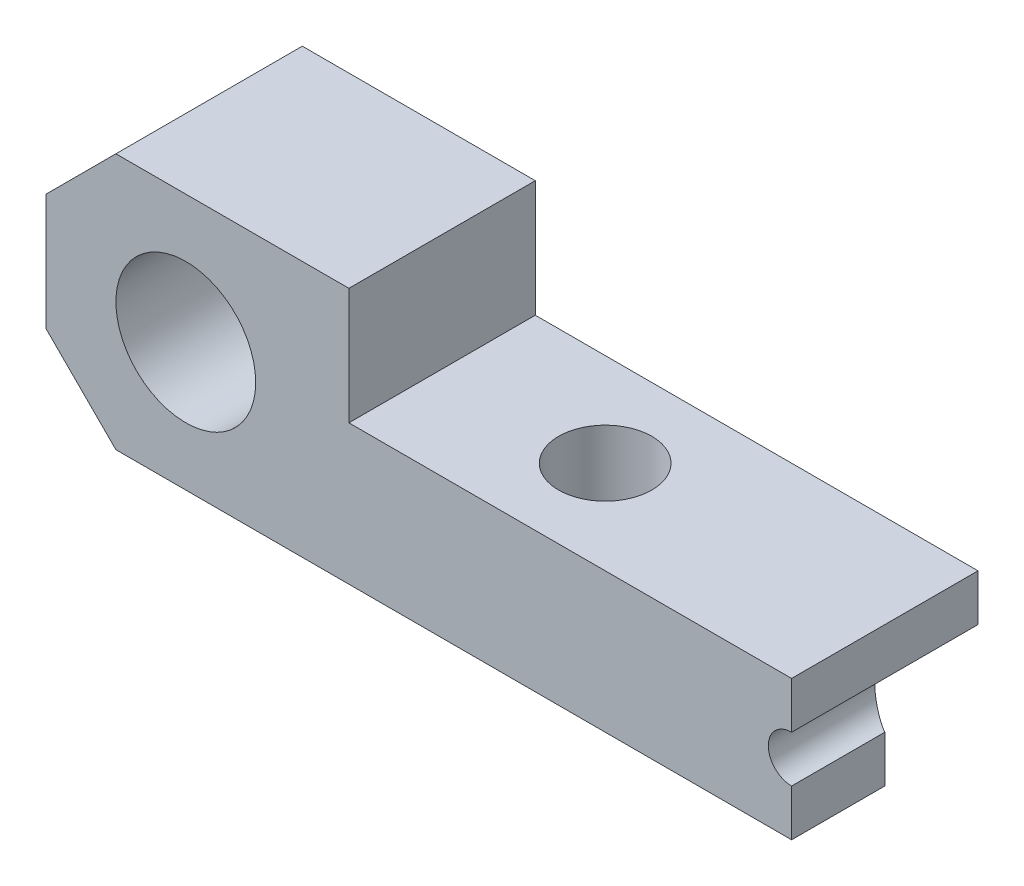
ISO-10303-21;
HEADER;
FILE_DESCRIPTION(('STEP AP214'),'2;1');
FILE_NAME('part.step','',(''),(''),'','','');
FILE_SCHEMA(('AUTOMOTIVE_DESIGN { 1 0 10303 214 1 1 1 1 }'));
ENDSEC;
DATA;
#1=APPLICATION_CONTEXT('core data for automotive mechanical design processes');
#2=APPLICATION_PROTOCOL_DEFINITION('international standard','automotive_design',2000,#1);
#3=PRODUCT_CONTEXT('',#1,'mechanical');
#4=PRODUCT('Part','Part','',(#3));
#5=PRODUCT_RELATED_PRODUCT_CATEGORY('part','',(#4));
#6=PRODUCT_DEFINITION_FORMATION('','',#4);
#7=PRODUCT_DEFINITION_CONTEXT('part definition',#1,'design');
#8=PRODUCT_DEFINITION('design','',#6,#7);
#9=PRODUCT_DEFINITION_SHAPE('','',#8);
#10=(LENGTH_UNIT() NAMED_UNIT(*) SI_UNIT(.MILLI.,.METRE.));
#11=(NAMED_UNIT(*) PLANE_ANGLE_UNIT() SI_UNIT($,.RADIAN.));
#12=(NAMED_UNIT(*) SI_UNIT($,.STERADIAN.) SOLID_ANGLE_UNIT());
#13=UNCERTAINTY_MEASURE_WITH_UNIT(LENGTH_MEASURE(1.E-05),#10,'distance_accuracy_value','');
#14=(GEOMETRIC_REPRESENTATION_CONTEXT(3) GLOBAL_UNCERTAINTY_ASSIGNED_CONTEXT((#13)) GLOBAL_UNIT_ASSIGNED_CONTEXT((#10,
#11,#12)) REPRESENTATION_CONTEXT('',''));
#15=CARTESIAN_POINT('',(0.,0.,0.));
#16=DIRECTION('',(0.,0.,1.));
#17=DIRECTION('',(1.,0.,0.));
#18=AXIS2_PLACEMENT_3D('',#15,#16,#17);
#19=CARTESIAN_POINT('',(32.,0.,8.));
#20=DIRECTION('',(-1.,0.,0.));
#21=DIRECTION('',(0.,0.,1.));
#22=AXIS2_PLACEMENT_3D('',#19,#20,#21);
#23=PLANE('',#22);
#24=DIRECTION('',(0.,0.,-1.));
#25=VECTOR('',#24,1.);
#26=CARTESIAN_POINT('',(32.,0.,8.));
#27=LINE('',#26,#25);
#28=CARTESIAN_POINT('',(32.,0.,8.));
#29=VERTEX_POINT('',#28);
#30=CARTESIAN_POINT('',(32.,0.,4.));
#31=VERTEX_POINT('',#30);
#32=EDGE_CURVE('E156',#29,#31,#27,.T.);
#33=ORIENTED_EDGE('',*,*,#32,.T.);
#34=DIRECTION('',(0.,-1.,0.));
#35=VECTOR('',#34,1.);
#36=CARTESIAN_POINT('',(32.,4.,4.));
#37=LINE('',#36,#35);
#38=CARTESIAN_POINT('',(32.,2.,4.));
#39=VERTEX_POINT('',#38);
#40=EDGE_CURVE('E141',#39,#31,#37,.T.);
#41=ORIENTED_EDGE('',*,*,#40,.F.);
#42=DIRECTION('',(0.,0.,1.));
#43=VECTOR('',#42,1.);
#44=CARTESIAN_POINT('',(32.,2.,0.));
#45=LINE('',#44,#43);
#46=CARTESIAN_POINT('',(32.,2.,8.));
#47=VERTEX_POINT('',#46);
#48=EDGE_CURVE('E149',#39,#47,#45,.T.);
#49=ORIENTED_EDGE('',*,*,#48,.T.);
#50=DIRECTION('',(0.,1.,0.));
#51=VECTOR('',#50,1.);
#52=CARTESIAN_POINT('',(32.,0.,8.));
#53=LINE('',#52,#51);
#54=EDGE_CURVE('E245',#29,#47,#53,.T.);
#55=ORIENTED_EDGE('',*,*,#54,.F.);
#56=EDGE_LOOP('',(#33,#41,#49,#55));
#57=FACE_BOUND('',#56,.T.);
#58=ADVANCED_FACE('F35',(#57),#23,.F.);
#59=CARTESIAN_POINT('',(0.,6.,8.));
#60=DIRECTION('',(0.,0.,1.));
#61=DIRECTION('',(1.,0.,0.));
#62=AXIS2_PLACEMENT_3D('',#59,#60,#61);
#63=PLANE('',#62);
#64=DIRECTION('',(0.,-1.,0.));
#65=VECTOR('',#64,1.);
#66=CARTESIAN_POINT('',(0.,0.,8.));
#67=LINE('',#66,#65);
#68=CARTESIAN_POINT('',(0.,8.00000000000001,8.));
#69=VERTEX_POINT('',#68);
#70=CARTESIAN_POINT('',(0.,3.00000000000001,8.));
#71=VERTEX_POINT('',#70);
#72=EDGE_CURVE('E188',#69,#71,#67,.T.);
#73=ORIENTED_EDGE('',*,*,#72,.T.);
#74=DIRECTION('',(-0.707106781186547,0.707106781186548,0.));
#75=VECTOR('',#74,1.);
#76=CARTESIAN_POINT('',(-1.5,4.50000000000001,8.));
#77=LINE('',#76,#75);
#78=CARTESIAN_POINT('',(3.,0.,8.));
#79=VERTEX_POINT('',#78);
#80=EDGE_CURVE('E43',#71,#79,#77,.F.);
#81=ORIENTED_EDGE('',*,*,#80,.T.);
#82=DIRECTION('',(1.,0.,0.));
#83=VECTOR('',#82,1.);
#84=CARTESIAN_POINT('',(0.,0.,8.));
#85=LINE('',#84,#83);
#86=EDGE_CURVE('E186',#79,#29,#85,.T.);
#87=ORIENTED_EDGE('',*,*,#86,.T.);
#88=ORIENTED_EDGE('',*,*,#54,.T.);
#89=CARTESIAN_POINT('',(32.,3.,8.));
#90=DIRECTION('',(0.,0.,1.));
#91=DIRECTION('',(1.,0.,0.));
#92=AXIS2_PLACEMENT_3D('',#89,#90,#91);
#93=CIRCLE('',#92,0.999999999999998);
#94=CARTESIAN_POINT('',(32.,4.,8.));
#95=VERTEX_POINT('',#94);
#96=EDGE_CURVE('E251',#95,#47,#93,.T.);
#97=ORIENTED_EDGE('',*,*,#96,.F.);
#98=CARTESIAN_POINT('',(32.,6.,8.));
#99=VERTEX_POINT('',#98);
#100=EDGE_CURVE('E155',#95,#99,#53,.T.);
#101=ORIENTED_EDGE('',*,*,#100,.T.);
#102=DIRECTION('',(-1.,0.,0.));
#103=VECTOR('',#102,1.);
#104=CARTESIAN_POINT('',(32.,6.,8.));
#105=LINE('',#104,#103);
#106=CARTESIAN_POINT('',(13.,6.,8.));
#107=VERTEX_POINT('',#106);
#108=EDGE_CURVE('E235',#99,#107,#105,.T.);
#109=ORIENTED_EDGE('',*,*,#108,.T.);
#110=DIRECTION('',(0.,1.,0.));
#111=VECTOR('',#110,1.);
#112=CARTESIAN_POINT('',(13.,11.,8.));
#113=LINE('',#112,#111);
#114=CARTESIAN_POINT('',(13.,11.,8.));
#115=VERTEX_POINT('',#114);
#116=EDGE_CURVE('E244',#107,#115,#113,.T.);
#117=ORIENTED_EDGE('',*,*,#116,.T.);
#118=DIRECTION('',(-1.,0.,0.));
#119=VECTOR('',#118,1.);
#120=CARTESIAN_POINT('',(0.,11.,8.));
#121=LINE('',#120,#119);
#122=CARTESIAN_POINT('',(3.,11.,8.));
#123=VERTEX_POINT('',#122);
#124=EDGE_CURVE('E214',#115,#123,#121,.T.);
#125=ORIENTED_EDGE('',*,*,#124,.T.);
#126=DIRECTION('',(0.707106781186549,0.707106781186546,0.));
#127=VECTOR('',#126,1.);
#128=CARTESIAN_POINT('',(-1.00000000000001,7.,8.));
#129=LINE('',#128,#127);
#130=EDGE_CURVE('E179',#123,#69,#129,.F.);
#131=ORIENTED_EDGE('',*,*,#130,.T.);
#132=EDGE_LOOP('',(#73,#81,#87,#88,#97,#101,#109,#117,#125,#131));
#133=FACE_BOUND('',#132,.T.);
#134=CARTESIAN_POINT('',(6.,5.5,8.));
#135=DIRECTION('',(0.,0.,1.));
#136=DIRECTION('',(1.,0.,0.));
#137=AXIS2_PLACEMENT_3D('',#134,#135,#136);
#138=CIRCLE('',#137,3.);
#139=CARTESIAN_POINT('',(9.,5.5,8.));
#140=VERTEX_POINT('',#139);
#141=EDGE_CURVE('E206',#140,#140,#138,.T.);
#142=ORIENTED_EDGE('',*,*,#141,.F.);
#143=EDGE_LOOP('',(#142));
#144=FACE_BOUND('',#143,.T.);
#145=ADVANCED_FACE('F183',(#133,#144),#63,.T.);
#146=CARTESIAN_POINT('',(0.,6.,0.));
#147=DIRECTION('',(0.,0.,1.));
#148=DIRECTION('',(1.,0.,0.));
#149=AXIS2_PLACEMENT_3D('',#146,#147,#148);
#150=PLANE('',#149);
#151=DIRECTION('',(1.,0.,0.));
#152=VECTOR('',#151,1.);
#153=CARTESIAN_POINT('',(0.,0.,0.));
#154=LINE('',#153,#152);
#155=CARTESIAN_POINT('',(3.,0.,0.));
#156=VERTEX_POINT('',#155);
#157=CARTESIAN_POINT('',(25.,0.,0.));
#158=VERTEX_POINT('',#157);
#159=EDGE_CURVE('E203',#156,#158,#154,.T.);
#160=ORIENTED_EDGE('',*,*,#159,.F.);
#161=DIRECTION('',(0.707106781186547,-0.707106781186548,0.));
#162=VECTOR('',#161,1.);
#163=CARTESIAN_POINT('',(3.,0.,0.));
#164=LINE('',#163,#162);
#165=CARTESIAN_POINT('',(0.,3.00000000000001,0.));
#166=VERTEX_POINT('',#165);
#167=EDGE_CURVE('E173',#156,#166,#164,.F.);
#168=ORIENTED_EDGE('',*,*,#167,.T.);
#169=DIRECTION('',(0.,-1.,0.));
#170=VECTOR('',#169,1.);
#171=CARTESIAN_POINT('',(0.,0.,0.));
#172=LINE('',#171,#170);
#173=CARTESIAN_POINT('',(0.,8.,0.));
#174=VERTEX_POINT('',#173);
#175=EDGE_CURVE('E202',#174,#166,#172,.T.);
#176=ORIENTED_EDGE('',*,*,#175,.F.);
#177=DIRECTION('',(-0.707106781186549,-0.707106781186546,0.));
#178=VECTOR('',#177,1.);
#179=CARTESIAN_POINT('',(0.,8.00000000000001,0.));
#180=LINE('',#179,#178);
#181=CARTESIAN_POINT('',(3.,11.,0.));
#182=VERTEX_POINT('',#181);
#183=EDGE_CURVE('E171',#174,#182,#180,.F.);
#184=ORIENTED_EDGE('',*,*,#183,.T.);
#185=DIRECTION('',(-1.,0.,0.));
#186=VECTOR('',#185,1.);
#187=CARTESIAN_POINT('',(0.,11.,0.));
#188=LINE('',#187,#186);
#189=CARTESIAN_POINT('',(13.,11.,0.));
#190=VERTEX_POINT('',#189);
#191=EDGE_CURVE('E222',#190,#182,#188,.T.);
#192=ORIENTED_EDGE('',*,*,#191,.F.);
#193=DIRECTION('',(0.,1.,0.));
#194=VECTOR('',#193,1.);
#195=CARTESIAN_POINT('',(13.,11.,0.));
#196=LINE('',#195,#194);
#197=CARTESIAN_POINT('',(13.,6.,0.));
#198=VERTEX_POINT('',#197);
#199=EDGE_CURVE('E220',#198,#190,#196,.T.);
#200=ORIENTED_EDGE('',*,*,#199,.F.);
#201=DIRECTION('',(-1.,0.,0.));
#202=VECTOR('',#201,1.);
#203=CARTESIAN_POINT('',(32.,6.,0.));
#204=LINE('',#203,#202);
#205=CARTESIAN_POINT('',(32.,6.,0.));
#206=VERTEX_POINT('',#205);
#207=EDGE_CURVE('E218',#206,#198,#204,.T.);
#208=ORIENTED_EDGE('',*,*,#207,.F.);
#209=DIRECTION('',(0.,1.,0.));
#210=VECTOR('',#209,1.);
#211=CARTESIAN_POINT('',(32.,0.,0.));
#212=LINE('',#211,#210);
#213=CARTESIAN_POINT('',(32.,4.,0.));
#214=VERTEX_POINT('',#213);
#215=EDGE_CURVE('E208',#214,#206,#212,.T.);
#216=ORIENTED_EDGE('',*,*,#215,.F.);
#217=DIRECTION('',(1.,0.,0.));
#218=VECTOR('',#217,1.);
#219=CARTESIAN_POINT('',(32.,4.,0.));
#220=LINE('',#219,#218);
#221=CARTESIAN_POINT('',(25.,4.,0.));
#222=VERTEX_POINT('',#221);
#223=EDGE_CURVE('E128',#222,#214,#220,.T.);
#224=ORIENTED_EDGE('',*,*,#223,.F.);
#225=DIRECTION('',(0.,-1.,0.));
#226=VECTOR('',#225,1.);
#227=CARTESIAN_POINT('',(25.,4.,0.));
#228=LINE('',#227,#226);
#229=EDGE_CURVE('E140',#222,#158,#228,.T.);
#230=ORIENTED_EDGE('',*,*,#229,.T.);
#231=EDGE_LOOP('',(#160,#168,#176,#184,#192,#200,#208,#216,#224,#230));
#232=FACE_BOUND('',#231,.T.);
#233=CARTESIAN_POINT('',(6.,5.5,0.));
#234=DIRECTION('',(0.,0.,1.));
#235=DIRECTION('',(1.,0.,0.));
#236=AXIS2_PLACEMENT_3D('',#233,#234,#235);
#237=CIRCLE('',#236,3.);
#238=CARTESIAN_POINT('',(9.,5.5,0.));
#239=VERTEX_POINT('',#238);
#240=EDGE_CURVE('E211',#239,#239,#237,.T.);
#241=ORIENTED_EDGE('',*,*,#240,.T.);
#242=EDGE_LOOP('',(#241));
#243=FACE_BOUND('',#242,.T.);
#244=ADVANCED_FACE('F200',(#232,#243),#150,.F.);
#245=CARTESIAN_POINT('',(0.,0.,8.));
#246=DIRECTION('',(1.,0.,0.));
#247=DIRECTION('',(0.,1.,0.));
#248=AXIS2_PLACEMENT_3D('',#245,#246,#247);
#249=PLANE('',#248);
#250=ORIENTED_EDGE('',*,*,#175,.T.);
#251=DIRECTION('',(0.,0.,1.));
#252=VECTOR('',#251,1.);
#253=CARTESIAN_POINT('',(0.,3.00000000000001,8.));
#254=LINE('',#253,#252);
#255=EDGE_CURVE('E56',#166,#71,#254,.T.);
#256=ORIENTED_EDGE('',*,*,#255,.T.);
#257=ORIENTED_EDGE('',*,*,#72,.F.);
#258=DIRECTION('',(0.,0.,-1.));
#259=VECTOR('',#258,1.);
#260=CARTESIAN_POINT('',(0.,8.00000000000001,8.));
#261=LINE('',#260,#259);
#262=EDGE_CURVE('E175',#69,#174,#261,.T.);
#263=ORIENTED_EDGE('',*,*,#262,.T.);
#264=EDGE_LOOP('',(#250,#256,#257,#263));
#265=FACE_BOUND('',#264,.T.);
#266=ADVANCED_FACE('F204',(#265),#249,.F.);
#267=CARTESIAN_POINT('',(0.,0.,8.));
#268=DIRECTION('',(0.,1.,0.));
#269=DIRECTION('',(0.,0.,1.));
#270=AXIS2_PLACEMENT_3D('',#267,#268,#269);
#271=PLANE('',#270);
#272=CARTESIAN_POINT('',(20.,0.,4.));
#273=DIRECTION('',(0.,-1.,0.));
#274=DIRECTION('',(0.,0.,-1.));
#275=AXIS2_PLACEMENT_3D('',#272,#273,#274);
#276=CIRCLE('',#275,2.);
#277=CARTESIAN_POINT('',(20.,0.,2.));
#278=VERTEX_POINT('',#277);
#279=EDGE_CURVE('E168',#278,#278,#276,.T.);
#280=ORIENTED_EDGE('',*,*,#279,.F.);
#281=EDGE_LOOP('',(#280));
#282=FACE_BOUND('',#281,.T.);
#283=ORIENTED_EDGE('',*,*,#86,.F.);
#284=DIRECTION('',(0.,0.,-1.));
#285=VECTOR('',#284,1.);
#286=CARTESIAN_POINT('',(3.,0.,8.));
#287=LINE('',#286,#285);
#288=EDGE_CURVE('E150',#79,#156,#287,.T.);
#289=ORIENTED_EDGE('',*,*,#288,.T.);
#290=ORIENTED_EDGE('',*,*,#159,.T.);
#291=DIRECTION('',(-0.868243142124459,0.,-0.496138938356834));
#292=VECTOR('',#291,1.);
#293=CARTESIAN_POINT('',(25.,0.,0.));
#294=LINE('',#293,#292);
#295=EDGE_CURVE('E167',#31,#158,#294,.T.);
#296=ORIENTED_EDGE('',*,*,#295,.F.);
#297=ORIENTED_EDGE('',*,*,#32,.F.);
#298=EDGE_LOOP('',(#283,#289,#290,#296,#297));
#299=FACE_BOUND('',#298,.T.);
#300=ADVANCED_FACE('F192',(#282,#299),#271,.F.);
#301=ORIENTED_EDGE('',*,*,#100,.F.);
#302=DIRECTION('',(0.,0.,1.));
#303=VECTOR('',#302,1.);
#304=CARTESIAN_POINT('',(32.,4.,0.));
#305=LINE('',#304,#303);
#306=CARTESIAN_POINT('',(32.,4.,4.));
#307=VERTEX_POINT('',#306);
#308=EDGE_CURVE('E147',#95,#307,#305,.F.);
#309=ORIENTED_EDGE('',*,*,#308,.T.);
#310=DIRECTION('',(0.,0.,1.));
#311=VECTOR('',#310,1.);
#312=CARTESIAN_POINT('',(32.,4.,4.));
#313=LINE('',#312,#311);
#314=EDGE_CURVE('E123',#214,#307,#313,.T.);
#315=ORIENTED_EDGE('',*,*,#314,.F.);
#316=ORIENTED_EDGE('',*,*,#215,.T.);
#317=DIRECTION('',(0.,0.,-1.));
#318=VECTOR('',#317,1.);
#319=CARTESIAN_POINT('',(32.,6.,8.));
#320=LINE('',#319,#318);
#321=EDGE_CURVE('E160',#99,#206,#320,.T.);
#322=ORIENTED_EDGE('',*,*,#321,.F.);
#323=EDGE_LOOP('',(#301,#309,#315,#316,#322));
#324=FACE_BOUND('',#323,.T.);
#325=ADVANCED_FACE('F153',(#324),#23,.F.);
#326=CARTESIAN_POINT('',(32.,6.,8.));
#327=DIRECTION('',(0.,-1.,0.));
#328=DIRECTION('',(1.,0.,0.));
#329=AXIS2_PLACEMENT_3D('',#326,#327,#328);
#330=PLANE('',#329);
#331=CARTESIAN_POINT('',(20.,6.,4.));
#332=DIRECTION('',(0.,-1.,0.));
#333=DIRECTION('',(1.,0.,0.));
#334=AXIS2_PLACEMENT_3D('',#331,#332,#333);
#335=CIRCLE('',#334,2.);
#336=CARTESIAN_POINT('',(22.,6.,4.));
#337=VERTEX_POINT('',#336);
#338=EDGE_CURVE('E164',#337,#337,#335,.T.);
#339=ORIENTED_EDGE('',*,*,#338,.T.);
#340=EDGE_LOOP('',(#339));
#341=FACE_BOUND('',#340,.T.);
#342=ORIENTED_EDGE('',*,*,#207,.T.);
#343=DIRECTION('',(0.,0.,-1.));
#344=VECTOR('',#343,1.);
#345=CARTESIAN_POINT('',(13.,6.,8.));
#346=LINE('',#345,#344);
#347=EDGE_CURVE('E227',#107,#198,#346,.T.);
#348=ORIENTED_EDGE('',*,*,#347,.F.);
#349=ORIENTED_EDGE('',*,*,#108,.F.);
#350=ORIENTED_EDGE('',*,*,#321,.T.);
#351=EDGE_LOOP('',(#342,#348,#349,#350));
#352=FACE_BOUND('',#351,.T.);
#353=ADVANCED_FACE('F233',(#341,#352),#330,.F.);
#354=CARTESIAN_POINT('',(13.,11.,8.));
#355=DIRECTION('',(-1.,0.,0.));
#356=DIRECTION('',(0.,-1.,0.));
#357=AXIS2_PLACEMENT_3D('',#354,#355,#356);
#358=PLANE('',#357);
#359=ORIENTED_EDGE('',*,*,#199,.T.);
#360=DIRECTION('',(0.,0.,-1.));
#361=VECTOR('',#360,1.);
#362=CARTESIAN_POINT('',(13.,11.,8.));
#363=LINE('',#362,#361);
#364=EDGE_CURVE('E224',#115,#190,#363,.T.);
#365=ORIENTED_EDGE('',*,*,#364,.F.);
#366=ORIENTED_EDGE('',*,*,#116,.F.);
#367=ORIENTED_EDGE('',*,*,#347,.T.);
#368=EDGE_LOOP('',(#359,#365,#366,#367));
#369=FACE_BOUND('',#368,.T.);
#370=ADVANCED_FACE('F240',(#369),#358,.F.);
#371=CARTESIAN_POINT('',(0.,11.,8.));
#372=DIRECTION('',(0.,-1.,0.));
#373=DIRECTION('',(0.,0.,-1.));
#374=AXIS2_PLACEMENT_3D('',#371,#372,#373);
#375=PLANE('',#374);
#376=ORIENTED_EDGE('',*,*,#191,.T.);
#377=DIRECTION('',(0.,0.,1.));
#378=VECTOR('',#377,1.);
#379=CARTESIAN_POINT('',(3.,11.,8.));
#380=LINE('',#379,#378);
#381=EDGE_CURVE('E11',#182,#123,#380,.T.);
#382=ORIENTED_EDGE('',*,*,#381,.T.);
#383=ORIENTED_EDGE('',*,*,#124,.F.);
#384=ORIENTED_EDGE('',*,*,#364,.T.);
#385=EDGE_LOOP('',(#376,#382,#383,#384));
#386=FACE_BOUND('',#385,.T.);
#387=ADVANCED_FACE('F242',(#386),#375,.F.);
#388=CARTESIAN_POINT('',(6.,5.5,8.));
#389=DIRECTION('',(0.,0.,-1.));
#390=DIRECTION('',(-1.,0.,0.));
#391=AXIS2_PLACEMENT_3D('',#388,#389,#390);
#392=CYLINDRICAL_SURFACE('',#391,3.);
#393=ORIENTED_EDGE('',*,*,#141,.T.);
#394=EDGE_LOOP('',(#393));
#395=FACE_BOUND('',#394,.T.);
#396=ORIENTED_EDGE('',*,*,#240,.F.);
#397=EDGE_LOOP('',(#396));
#398=FACE_BOUND('',#397,.T.);
#399=ADVANCED_FACE('F286',(#395,#398),#392,.F.);
#400=CARTESIAN_POINT('',(32.,3.,0.));
#401=DIRECTION('',(0.,0.,1.));
#402=DIRECTION('',(1.,0.,0.));
#403=AXIS2_PLACEMENT_3D('',#400,#401,#402);
#404=CYLINDRICAL_SURFACE('',#403,0.999999999999998);
#405=ORIENTED_EDGE('',*,*,#48,.F.);
#406=CARTESIAN_POINT('',(32.,3.,4.));
#407=DIRECTION('',(-0.496138938356834,0.,0.868243142124459));
#408=DIRECTION('',(0.868243142124459,0.,0.496138938356834));
#409=AXIS2_PLACEMENT_3D('',#406,#407,#408);
#410=ELLIPSE('',#409,1.15175110689979,0.999999999999998);
#411=EDGE_CURVE('E136',#39,#307,#410,.F.);
#412=ORIENTED_EDGE('',*,*,#411,.T.);
#413=ORIENTED_EDGE('',*,*,#308,.F.);
#414=ORIENTED_EDGE('',*,*,#96,.T.);
#415=EDGE_LOOP('',(#405,#412,#413,#414));
#416=FACE_BOUND('',#415,.T.);
#417=ADVANCED_FACE('F145',(#416),#404,.F.);
#418=CARTESIAN_POINT('',(25.,4.,0.));
#419=DIRECTION('',(-0.496138938356834,0.,0.868243142124459));
#420=DIRECTION('',(0.868243142124459,0.,0.496138938356834));
#421=AXIS2_PLACEMENT_3D('',#418,#419,#420);
#422=PLANE('',#421);
#423=ORIENTED_EDGE('',*,*,#40,.T.);
#424=ORIENTED_EDGE('',*,*,#295,.T.);
#425=ORIENTED_EDGE('',*,*,#229,.F.);
#426=DIRECTION('',(-0.868243142124459,0.,-0.496138938356834));
#427=VECTOR('',#426,1.);
#428=CARTESIAN_POINT('',(25.,4.,0.));
#429=LINE('',#428,#427);
#430=EDGE_CURVE('E126',#307,#222,#429,.T.);
#431=ORIENTED_EDGE('',*,*,#430,.F.);
#432=ORIENTED_EDGE('',*,*,#411,.F.);
#433=EDGE_LOOP('',(#423,#424,#425,#431,#432));
#434=FACE_BOUND('',#433,.T.);
#435=ADVANCED_FACE('F135',(#434),#422,.F.);
#436=CARTESIAN_POINT('',(32.,4.,0.));
#437=DIRECTION('',(0.,-1.,0.));
#438=DIRECTION('',(0.,0.,-1.));
#439=AXIS2_PLACEMENT_3D('',#436,#437,#438);
#440=PLANE('',#439);
#441=ORIENTED_EDGE('',*,*,#223,.T.);
#442=ORIENTED_EDGE('',*,*,#314,.T.);
#443=ORIENTED_EDGE('',*,*,#430,.T.);
#444=EDGE_LOOP('',(#441,#442,#443));
#445=FACE_BOUND('',#444,.T.);
#446=ADVANCED_FACE('F125',(#445),#440,.T.);
#447=CARTESIAN_POINT('',(20.,11.,4.));
#448=DIRECTION('',(0.,-1.,0.));
#449=DIRECTION('',(0.,0.,-1.));
#450=AXIS2_PLACEMENT_3D('',#447,#448,#449);
#451=CYLINDRICAL_SURFACE('',#450,2.);
#452=ORIENTED_EDGE('',*,*,#279,.T.);
#453=EDGE_LOOP('',(#452));
#454=FACE_BOUND('',#453,.T.);
#455=ORIENTED_EDGE('',*,*,#338,.F.);
#456=EDGE_LOOP('',(#455));
#457=FACE_BOUND('',#456,.T.);
#458=ADVANCED_FACE('F261',(#454,#457),#451,.F.);
#459=CARTESIAN_POINT('',(3.,0.,8.));
#460=DIRECTION('',(0.707106781186548,0.707106781186547,0.));
#461=DIRECTION('',(-0.707106781186547,0.707106781186548,0.));
#462=AXIS2_PLACEMENT_3D('',#459,#460,#461);
#463=PLANE('',#462);
#464=ORIENTED_EDGE('',*,*,#80,.F.);
#465=ORIENTED_EDGE('',*,*,#255,.F.);
#466=ORIENTED_EDGE('',*,*,#167,.F.);
#467=ORIENTED_EDGE('',*,*,#288,.F.);
#468=EDGE_LOOP('',(#464,#465,#466,#467));
#469=FACE_BOUND('',#468,.T.);
#470=ADVANCED_FACE('F197',(#469),#463,.F.);
#471=CARTESIAN_POINT('',(0.,8.00000000000001,8.));
#472=DIRECTION('',(0.707106781186546,-0.707106781186549,0.));
#473=DIRECTION('',(0.707106781186549,0.707106781186546,0.));
#474=AXIS2_PLACEMENT_3D('',#471,#472,#473);
#475=PLANE('',#474);
#476=ORIENTED_EDGE('',*,*,#130,.F.);
#477=ORIENTED_EDGE('',*,*,#381,.F.);
#478=ORIENTED_EDGE('',*,*,#183,.F.);
#479=ORIENTED_EDGE('',*,*,#262,.F.);
#480=EDGE_LOOP('',(#476,#477,#478,#479));
#481=FACE_BOUND('',#480,.T.);
#482=ADVANCED_FACE('F37',(#481),#475,.F.);
#483=CLOSED_SHELL('',(#58,#145,#244,#266,#300,#325,#353,#370,#387,#399,#417,#435,#446,#458,#470,#482));
#484=MANIFOLD_SOLID_BREP('B2',#483);
#485=ADVANCED_BREP_SHAPE_REPRESENTATION('',(#18,#484),#14);
#486=SHAPE_DEFINITION_REPRESENTATION(#9,#485);
ENDSEC;
END-ISO-10303-21;
